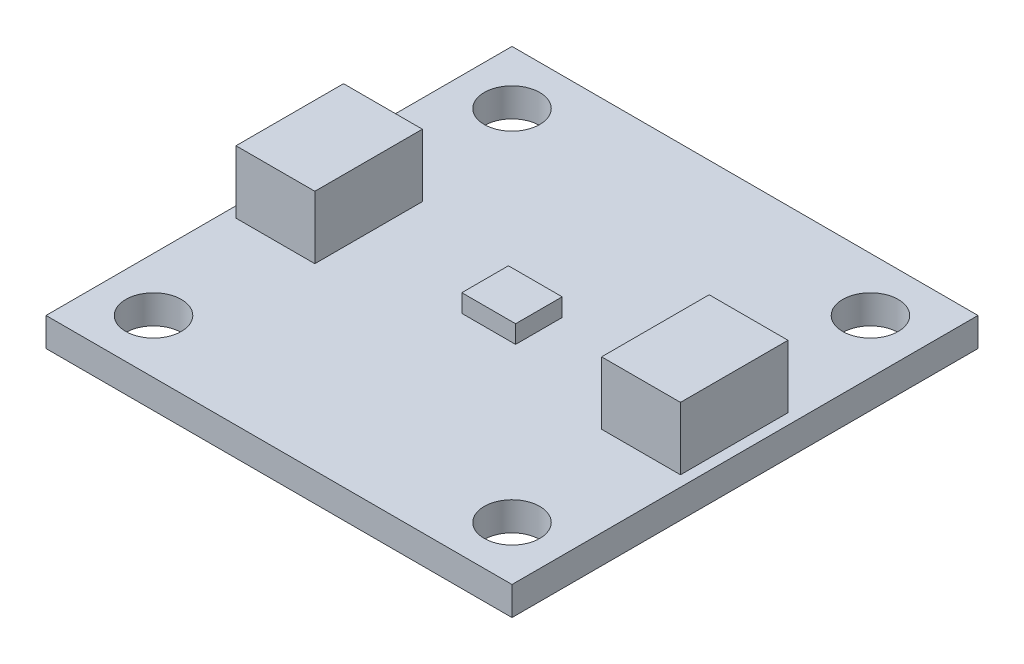
ISO-10303-21;
HEADER;
FILE_DESCRIPTION(('STEP AP214'),'2;1');
FILE_NAME('part.step','',(''),(''),'','','');
FILE_SCHEMA(('AUTOMOTIVE_DESIGN { 1 0 10303 214 1 1 1 1 }'));
ENDSEC;
DATA;
#1=APPLICATION_CONTEXT('core data for automotive mechanical design processes');
#2=APPLICATION_PROTOCOL_DEFINITION('international standard','automotive_design',2000,#1);
#3=PRODUCT_CONTEXT('',#1,'mechanical');
#4=PRODUCT('Part','Part','',(#3));
#5=PRODUCT_RELATED_PRODUCT_CATEGORY('part','',(#4));
#6=PRODUCT_DEFINITION_FORMATION('','',#4);
#7=PRODUCT_DEFINITION_CONTEXT('part definition',#1,'design');
#8=PRODUCT_DEFINITION('design','',#6,#7);
#9=PRODUCT_DEFINITION_SHAPE('','',#8);
#10=(LENGTH_UNIT() NAMED_UNIT(*) SI_UNIT(.MILLI.,.METRE.));
#11=(NAMED_UNIT(*) PLANE_ANGLE_UNIT() SI_UNIT($,.RADIAN.));
#12=(NAMED_UNIT(*) SI_UNIT($,.STERADIAN.) SOLID_ANGLE_UNIT());
#13=UNCERTAINTY_MEASURE_WITH_UNIT(LENGTH_MEASURE(1.E-05),#10,'distance_accuracy_value','');
#14=(GEOMETRIC_REPRESENTATION_CONTEXT(3) GLOBAL_UNCERTAINTY_ASSIGNED_CONTEXT((#13)) GLOBAL_UNIT_ASSIGNED_CONTEXT((#10,
#11,#12)) REPRESENTATION_CONTEXT('',''));
#15=CARTESIAN_POINT('',(0.,0.,0.));
#16=DIRECTION('',(0.,0.,1.));
#17=DIRECTION('',(1.,0.,0.));
#18=AXIS2_PLACEMENT_3D('',#15,#16,#17);
#19=CARTESIAN_POINT('',(0.,1.6,0.));
#20=DIRECTION('',(0.,-1.,0.));
#21=DIRECTION('',(0.,0.,-1.));
#22=AXIS2_PLACEMENT_3D('',#19,#20,#21);
#23=PLANE('',#22);
#24=DIRECTION('',(0.,0.,1.));
#25=VECTOR('',#24,1.);
#26=CARTESIAN_POINT('',(8.,1.6,3.));
#27=LINE('',#26,#25);
#28=CARTESIAN_POINT('',(8.,1.6,-3.));
#29=VERTEX_POINT('',#28);
#30=CARTESIAN_POINT('',(8.,1.6,3.));
#31=VERTEX_POINT('',#30);
#32=EDGE_CURVE('E167',#29,#31,#27,.T.);
#33=ORIENTED_EDGE('',*,*,#32,.F.);
#34=DIRECTION('',(-1.,0.,0.));
#35=VECTOR('',#34,1.);
#36=CARTESIAN_POINT('',(12.4,1.6,-3.));
#37=LINE('',#36,#35);
#38=CARTESIAN_POINT('',(12.4,1.6,-3.));
#39=VERTEX_POINT('',#38);
#40=EDGE_CURVE('E180',#39,#29,#37,.T.);
#41=ORIENTED_EDGE('',*,*,#40,.F.);
#42=DIRECTION('',(0.,0.,-1.));
#43=VECTOR('',#42,1.);
#44=CARTESIAN_POINT('',(12.4,1.6,3.));
#45=LINE('',#44,#43);
#46=CARTESIAN_POINT('',(12.4,1.6,3.));
#47=VERTEX_POINT('',#46);
#48=EDGE_CURVE('E189',#47,#39,#45,.T.);
#49=ORIENTED_EDGE('',*,*,#48,.F.);
#50=DIRECTION('',(1.,0.,0.));
#51=VECTOR('',#50,1.);
#52=CARTESIAN_POINT('',(12.4,1.6,3.));
#53=LINE('',#52,#51);
#54=EDGE_CURVE('E170',#31,#47,#53,.T.);
#55=ORIENTED_EDGE('',*,*,#54,.F.);
#56=EDGE_LOOP('',(#33,#41,#49,#55));
#57=FACE_BOUND('',#56,.T.);
#58=CARTESIAN_POINT('',(-10.,1.6,10.));
#59=DIRECTION('',(0.,1.,0.));
#60=DIRECTION('',(0.,0.,1.));
#61=AXIS2_PLACEMENT_3D('',#58,#59,#60);
#62=CIRCLE('',#61,1.55);
#63=CARTESIAN_POINT('',(-10.,1.6,11.55));
#64=VERTEX_POINT('',#63);
#65=EDGE_CURVE('E239',#64,#64,#62,.T.);
#66=ORIENTED_EDGE('',*,*,#65,.F.);
#67=EDGE_LOOP('',(#66));
#68=FACE_BOUND('',#67,.T.);
#69=CARTESIAN_POINT('',(10.,1.6,10.));
#70=DIRECTION('',(0.,1.,0.));
#71=DIRECTION('',(0.,0.,1.));
#72=AXIS2_PLACEMENT_3D('',#69,#70,#71);
#73=CIRCLE('',#72,1.55);
#74=CARTESIAN_POINT('',(10.,1.6,11.55));
#75=VERTEX_POINT('',#74);
#76=EDGE_CURVE('E245',#75,#75,#73,.T.);
#77=ORIENTED_EDGE('',*,*,#76,.F.);
#78=EDGE_LOOP('',(#77));
#79=FACE_BOUND('',#78,.T.);
#80=CARTESIAN_POINT('',(10.,1.6,-10.));
#81=DIRECTION('',(0.,1.,0.));
#82=DIRECTION('',(0.,0.,1.));
#83=AXIS2_PLACEMENT_3D('',#80,#81,#82);
#84=CIRCLE('',#83,1.55);
#85=CARTESIAN_POINT('',(10.,1.6,-8.45));
#86=VERTEX_POINT('',#85);
#87=EDGE_CURVE('E251',#86,#86,#84,.T.);
#88=ORIENTED_EDGE('',*,*,#87,.F.);
#89=EDGE_LOOP('',(#88));
#90=FACE_BOUND('',#89,.T.);
#91=CARTESIAN_POINT('',(-10.,1.6,-10.));
#92=DIRECTION('',(0.,1.,0.));
#93=DIRECTION('',(0.,0.,1.));
#94=AXIS2_PLACEMENT_3D('',#91,#92,#93);
#95=CIRCLE('',#94,1.55);
#96=CARTESIAN_POINT('',(-10.,1.6,-8.45));
#97=VERTEX_POINT('',#96);
#98=EDGE_CURVE('E257',#97,#97,#95,.T.);
#99=ORIENTED_EDGE('',*,*,#98,.F.);
#100=EDGE_LOOP('',(#99));
#101=FACE_BOUND('',#100,.T.);
#102=DIRECTION('',(0.,0.,-1.));
#103=VECTOR('',#102,1.);
#104=CARTESIAN_POINT('',(13.,1.6,13.));
#105=LINE('',#104,#103);
#106=CARTESIAN_POINT('',(13.,1.6,13.));
#107=VERTEX_POINT('',#106);
#108=CARTESIAN_POINT('',(13.,1.6,-13.));
#109=VERTEX_POINT('',#108);
#110=EDGE_CURVE('E263',#107,#109,#105,.T.);
#111=ORIENTED_EDGE('',*,*,#110,.T.);
#112=DIRECTION('',(-1.,0.,0.));
#113=VECTOR('',#112,1.);
#114=CARTESIAN_POINT('',(-13.,1.6,-13.));
#115=LINE('',#114,#113);
#116=CARTESIAN_POINT('',(-13.,1.6,-13.));
#117=VERTEX_POINT('',#116);
#118=EDGE_CURVE('E266',#109,#117,#115,.T.);
#119=ORIENTED_EDGE('',*,*,#118,.T.);
#120=DIRECTION('',(0.,0.,1.));
#121=VECTOR('',#120,1.);
#122=CARTESIAN_POINT('',(-13.,1.6,13.));
#123=LINE('',#122,#121);
#124=CARTESIAN_POINT('',(-13.,1.6,13.));
#125=VERTEX_POINT('',#124);
#126=EDGE_CURVE('E269',#117,#125,#123,.T.);
#127=ORIENTED_EDGE('',*,*,#126,.T.);
#128=DIRECTION('',(1.,0.,0.));
#129=VECTOR('',#128,1.);
#130=CARTESIAN_POINT('',(-13.,1.6,13.));
#131=LINE('',#130,#129);
#132=EDGE_CURVE('E271',#125,#107,#131,.T.);
#133=ORIENTED_EDGE('',*,*,#132,.T.);
#134=EDGE_LOOP('',(#111,#119,#127,#133));
#135=FACE_BOUND('',#134,.T.);
#136=DIRECTION('',(0.,0.,1.));
#137=VECTOR('',#136,1.);
#138=CARTESIAN_POINT('',(-12.4,1.6,3.));
#139=LINE('',#138,#137);
#140=CARTESIAN_POINT('',(-12.4,1.6,-3.));
#141=VERTEX_POINT('',#140);
#142=CARTESIAN_POINT('',(-12.4,1.6,3.));
#143=VERTEX_POINT('',#142);
#144=EDGE_CURVE('E205',#141,#143,#139,.T.);
#145=ORIENTED_EDGE('',*,*,#144,.F.);
#146=DIRECTION('',(-1.,0.,0.));
#147=VECTOR('',#146,1.);
#148=CARTESIAN_POINT('',(-8.,1.6,-3.));
#149=LINE('',#148,#147);
#150=CARTESIAN_POINT('',(-8.,1.6,-3.));
#151=VERTEX_POINT('',#150);
#152=EDGE_CURVE('E210',#151,#141,#149,.T.);
#153=ORIENTED_EDGE('',*,*,#152,.F.);
#154=DIRECTION('',(0.,0.,-1.));
#155=VECTOR('',#154,1.);
#156=CARTESIAN_POINT('',(-8.,1.6,3.));
#157=LINE('',#156,#155);
#158=CARTESIAN_POINT('',(-8.,1.6,3.));
#159=VERTEX_POINT('',#158);
#160=EDGE_CURVE('E222',#159,#151,#157,.T.);
#161=ORIENTED_EDGE('',*,*,#160,.F.);
#162=DIRECTION('',(1.,0.,0.));
#163=VECTOR('',#162,1.);
#164=CARTESIAN_POINT('',(-8.,1.6,3.));
#165=LINE('',#164,#163);
#166=EDGE_CURVE('E219',#143,#159,#165,.T.);
#167=ORIENTED_EDGE('',*,*,#166,.F.);
#168=EDGE_LOOP('',(#145,#153,#161,#167));
#169=FACE_BOUND('',#168,.T.);
#170=DIRECTION('',(0.,0.,-1.));
#171=VECTOR('',#170,1.);
#172=CARTESIAN_POINT('',(1.5,1.6,1.3));
#173=LINE('',#172,#171);
#174=CARTESIAN_POINT('',(1.5,1.6,1.3));
#175=VERTEX_POINT('',#174);
#176=CARTESIAN_POINT('',(1.5,1.6,-1.3));
#177=VERTEX_POINT('',#176);
#178=EDGE_CURVE('E166',#175,#177,#173,.T.);
#179=ORIENTED_EDGE('',*,*,#178,.F.);
#180=DIRECTION('',(1.,0.,0.));
#181=VECTOR('',#180,1.);
#182=CARTESIAN_POINT('',(-1.5,1.6,1.3));
#183=LINE('',#182,#181);
#184=CARTESIAN_POINT('',(-1.5,1.6,1.3));
#185=VERTEX_POINT('',#184);
#186=EDGE_CURVE('E163',#185,#175,#183,.T.);
#187=ORIENTED_EDGE('',*,*,#186,.F.);
#188=DIRECTION('',(0.,0.,1.));
#189=VECTOR('',#188,1.);
#190=CARTESIAN_POINT('',(-1.5,1.6,1.3));
#191=LINE('',#190,#189);
#192=CARTESIAN_POINT('',(-1.5,1.6,-1.3));
#193=VERTEX_POINT('',#192);
#194=EDGE_CURVE('E53',#193,#185,#191,.T.);
#195=ORIENTED_EDGE('',*,*,#194,.F.);
#196=DIRECTION('',(-1.,0.,0.));
#197=VECTOR('',#196,1.);
#198=CARTESIAN_POINT('',(-1.5,1.6,-1.3));
#199=LINE('',#198,#197);
#200=EDGE_CURVE('E48',#177,#193,#199,.T.);
#201=ORIENTED_EDGE('',*,*,#200,.F.);
#202=EDGE_LOOP('',(#179,#187,#195,#201));
#203=FACE_BOUND('',#202,.T.);
#204=ADVANCED_FACE('F33',(#57,#68,#79,#90,#101,#135,#169,#203),#23,.F.);
#205=CARTESIAN_POINT('',(0.,0.,0.));
#206=DIRECTION('',(0.,-1.,0.));
#207=DIRECTION('',(0.,0.,-1.));
#208=AXIS2_PLACEMENT_3D('',#205,#206,#207);
#209=PLANE('',#208);
#210=CARTESIAN_POINT('',(10.,0.,10.));
#211=DIRECTION('',(0.,1.,0.));
#212=DIRECTION('',(0.,0.,1.));
#213=AXIS2_PLACEMENT_3D('',#210,#211,#212);
#214=CIRCLE('',#213,1.55);
#215=CARTESIAN_POINT('',(10.,0.,11.55));
#216=VERTEX_POINT('',#215);
#217=EDGE_CURVE('E242',#216,#216,#214,.T.);
#218=ORIENTED_EDGE('',*,*,#217,.T.);
#219=EDGE_LOOP('',(#218));
#220=FACE_BOUND('',#219,.T.);
#221=CARTESIAN_POINT('',(-10.,0.,-10.));
#222=DIRECTION('',(0.,1.,0.));
#223=DIRECTION('',(0.,0.,1.));
#224=AXIS2_PLACEMENT_3D('',#221,#222,#223);
#225=CIRCLE('',#224,1.55);
#226=CARTESIAN_POINT('',(-10.,0.,-8.45));
#227=VERTEX_POINT('',#226);
#228=EDGE_CURVE('E254',#227,#227,#225,.T.);
#229=ORIENTED_EDGE('',*,*,#228,.T.);
#230=EDGE_LOOP('',(#229));
#231=FACE_BOUND('',#230,.T.);
#232=DIRECTION('',(0.,0.,-1.));
#233=VECTOR('',#232,1.);
#234=CARTESIAN_POINT('',(13.,0.,13.));
#235=LINE('',#234,#233);
#236=CARTESIAN_POINT('',(13.,0.,13.));
#237=VERTEX_POINT('',#236);
#238=CARTESIAN_POINT('',(13.,0.,-13.));
#239=VERTEX_POINT('',#238);
#240=EDGE_CURVE('E260',#237,#239,#235,.T.);
#241=ORIENTED_EDGE('',*,*,#240,.F.);
#242=DIRECTION('',(1.,0.,0.));
#243=VECTOR('',#242,1.);
#244=CARTESIAN_POINT('',(-13.,0.,13.));
#245=LINE('',#244,#243);
#246=CARTESIAN_POINT('',(-13.,0.,13.));
#247=VERTEX_POINT('',#246);
#248=EDGE_CURVE('E267',#247,#237,#245,.T.);
#249=ORIENTED_EDGE('',*,*,#248,.F.);
#250=DIRECTION('',(0.,0.,1.));
#251=VECTOR('',#250,1.);
#252=CARTESIAN_POINT('',(-13.,0.,13.));
#253=LINE('',#252,#251);
#254=CARTESIAN_POINT('',(-13.,0.,-13.));
#255=VERTEX_POINT('',#254);
#256=EDGE_CURVE('E278',#255,#247,#253,.T.);
#257=ORIENTED_EDGE('',*,*,#256,.F.);
#258=DIRECTION('',(-1.,0.,0.));
#259=VECTOR('',#258,1.);
#260=CARTESIAN_POINT('',(-13.,0.,-13.));
#261=LINE('',#260,#259);
#262=EDGE_CURVE('E276',#239,#255,#261,.T.);
#263=ORIENTED_EDGE('',*,*,#262,.F.);
#264=EDGE_LOOP('',(#241,#249,#257,#263));
#265=FACE_BOUND('',#264,.T.);
#266=CARTESIAN_POINT('',(10.,0.,-10.));
#267=DIRECTION('',(0.,1.,0.));
#268=DIRECTION('',(0.,0.,1.));
#269=AXIS2_PLACEMENT_3D('',#266,#267,#268);
#270=CIRCLE('',#269,1.55);
#271=CARTESIAN_POINT('',(10.,0.,-8.45));
#272=VERTEX_POINT('',#271);
#273=EDGE_CURVE('E248',#272,#272,#270,.T.);
#274=ORIENTED_EDGE('',*,*,#273,.T.);
#275=EDGE_LOOP('',(#274));
#276=FACE_BOUND('',#275,.T.);
#277=CARTESIAN_POINT('',(-10.,0.,10.));
#278=DIRECTION('',(0.,1.,0.));
#279=DIRECTION('',(0.,0.,1.));
#280=AXIS2_PLACEMENT_3D('',#277,#278,#279);
#281=CIRCLE('',#280,1.55);
#282=CARTESIAN_POINT('',(-10.,0.,11.55));
#283=VERTEX_POINT('',#282);
#284=EDGE_CURVE('E238',#283,#283,#281,.T.);
#285=ORIENTED_EDGE('',*,*,#284,.T.);
#286=EDGE_LOOP('',(#285));
#287=FACE_BOUND('',#286,.T.);
#288=ADVANCED_FACE('F296',(#220,#231,#265,#276,#287),#209,.T.);
#289=CARTESIAN_POINT('',(13.,1.6,13.));
#290=DIRECTION('',(-1.,0.,0.));
#291=DIRECTION('',(0.,0.,1.));
#292=AXIS2_PLACEMENT_3D('',#289,#290,#291);
#293=PLANE('',#292);
#294=ORIENTED_EDGE('',*,*,#240,.T.);
#295=DIRECTION('',(0.,-1.,0.));
#296=VECTOR('',#295,1.);
#297=CARTESIAN_POINT('',(13.,1.6,-13.));
#298=LINE('',#297,#296);
#299=EDGE_CURVE('E11',#109,#239,#298,.T.);
#300=ORIENTED_EDGE('',*,*,#299,.F.);
#301=ORIENTED_EDGE('',*,*,#110,.F.);
#302=DIRECTION('',(0.,-1.,0.));
#303=VECTOR('',#302,1.);
#304=CARTESIAN_POINT('',(13.,1.6,13.));
#305=LINE('',#304,#303);
#306=EDGE_CURVE('E273',#107,#237,#305,.T.);
#307=ORIENTED_EDGE('',*,*,#306,.T.);
#308=EDGE_LOOP('',(#294,#300,#301,#307));
#309=FACE_BOUND('',#308,.T.);
#310=ADVANCED_FACE('F35',(#309),#293,.F.);
#311=CARTESIAN_POINT('',(-13.,1.6,-13.));
#312=DIRECTION('',(0.,0.,1.));
#313=DIRECTION('',(1.,0.,0.));
#314=AXIS2_PLACEMENT_3D('',#311,#312,#313);
#315=PLANE('',#314);
#316=ORIENTED_EDGE('',*,*,#262,.T.);
#317=DIRECTION('',(0.,-1.,0.));
#318=VECTOR('',#317,1.);
#319=CARTESIAN_POINT('',(-13.,1.6,-13.));
#320=LINE('',#319,#318);
#321=EDGE_CURVE('E41',#117,#255,#320,.T.);
#322=ORIENTED_EDGE('',*,*,#321,.F.);
#323=ORIENTED_EDGE('',*,*,#118,.F.);
#324=ORIENTED_EDGE('',*,*,#299,.T.);
#325=EDGE_LOOP('',(#316,#322,#323,#324));
#326=FACE_BOUND('',#325,.T.);
#327=ADVANCED_FACE('F307',(#326),#315,.F.);
#328=CARTESIAN_POINT('',(-13.,1.6,13.));
#329=DIRECTION('',(1.,0.,0.));
#330=DIRECTION('',(0.,0.,-1.));
#331=AXIS2_PLACEMENT_3D('',#328,#329,#330);
#332=PLANE('',#331);
#333=ORIENTED_EDGE('',*,*,#256,.T.);
#334=DIRECTION('',(0.,-1.,0.));
#335=VECTOR('',#334,1.);
#336=CARTESIAN_POINT('',(-13.,1.6,13.));
#337=LINE('',#336,#335);
#338=EDGE_CURVE('E283',#125,#247,#337,.T.);
#339=ORIENTED_EDGE('',*,*,#338,.F.);
#340=ORIENTED_EDGE('',*,*,#126,.F.);
#341=ORIENTED_EDGE('',*,*,#321,.T.);
#342=EDGE_LOOP('',(#333,#339,#340,#341));
#343=FACE_BOUND('',#342,.T.);
#344=ADVANCED_FACE('F290',(#343),#332,.F.);
#345=CARTESIAN_POINT('',(-13.,1.6,13.));
#346=DIRECTION('',(0.,0.,-1.));
#347=DIRECTION('',(-1.,0.,0.));
#348=AXIS2_PLACEMENT_3D('',#345,#346,#347);
#349=PLANE('',#348);
#350=ORIENTED_EDGE('',*,*,#248,.T.);
#351=ORIENTED_EDGE('',*,*,#306,.F.);
#352=ORIENTED_EDGE('',*,*,#132,.F.);
#353=ORIENTED_EDGE('',*,*,#338,.T.);
#354=EDGE_LOOP('',(#350,#351,#352,#353));
#355=FACE_BOUND('',#354,.T.);
#356=ADVANCED_FACE('F300',(#355),#349,.F.);
#357=CARTESIAN_POINT('',(-10.,1.6,-10.));
#358=DIRECTION('',(0.,-1.,0.));
#359=DIRECTION('',(0.,0.,-1.));
#360=AXIS2_PLACEMENT_3D('',#357,#358,#359);
#361=CYLINDRICAL_SURFACE('',#360,1.55);
#362=ORIENTED_EDGE('',*,*,#98,.T.);
#363=EDGE_LOOP('',(#362));
#364=FACE_BOUND('',#363,.T.);
#365=ORIENTED_EDGE('',*,*,#228,.F.);
#366=EDGE_LOOP('',(#365));
#367=FACE_BOUND('',#366,.T.);
#368=ADVANCED_FACE('F324',(#364,#367),#361,.F.);
#369=CARTESIAN_POINT('',(10.,1.6,-10.));
#370=DIRECTION('',(0.,-1.,0.));
#371=DIRECTION('',(0.,0.,-1.));
#372=AXIS2_PLACEMENT_3D('',#369,#370,#371);
#373=CYLINDRICAL_SURFACE('',#372,1.55);
#374=ORIENTED_EDGE('',*,*,#87,.T.);
#375=EDGE_LOOP('',(#374));
#376=FACE_BOUND('',#375,.T.);
#377=ORIENTED_EDGE('',*,*,#273,.F.);
#378=EDGE_LOOP('',(#377));
#379=FACE_BOUND('',#378,.T.);
#380=ADVANCED_FACE('F331',(#376,#379),#373,.F.);
#381=CARTESIAN_POINT('',(10.,1.6,10.));
#382=DIRECTION('',(0.,-1.,0.));
#383=DIRECTION('',(0.,0.,-1.));
#384=AXIS2_PLACEMENT_3D('',#381,#382,#383);
#385=CYLINDRICAL_SURFACE('',#384,1.55);
#386=ORIENTED_EDGE('',*,*,#76,.T.);
#387=EDGE_LOOP('',(#386));
#388=FACE_BOUND('',#387,.T.);
#389=ORIENTED_EDGE('',*,*,#217,.F.);
#390=EDGE_LOOP('',(#389));
#391=FACE_BOUND('',#390,.T.);
#392=ADVANCED_FACE('F336',(#388,#391),#385,.F.);
#393=CARTESIAN_POINT('',(-10.,1.6,10.));
#394=DIRECTION('',(0.,-1.,0.));
#395=DIRECTION('',(0.,0.,-1.));
#396=AXIS2_PLACEMENT_3D('',#393,#394,#395);
#397=CYLINDRICAL_SURFACE('',#396,1.55);
#398=ORIENTED_EDGE('',*,*,#65,.T.);
#399=EDGE_LOOP('',(#398));
#400=FACE_BOUND('',#399,.T.);
#401=ORIENTED_EDGE('',*,*,#284,.F.);
#402=EDGE_LOOP('',(#401));
#403=FACE_BOUND('',#402,.T.);
#404=ADVANCED_FACE('F346',(#400,#403),#397,.F.);
#405=CARTESIAN_POINT('',(-12.4,5.1,3.));
#406=DIRECTION('',(1.,0.,0.));
#407=DIRECTION('',(0.,0.,-1.));
#408=AXIS2_PLACEMENT_3D('',#405,#406,#407);
#409=PLANE('',#408);
#410=ORIENTED_EDGE('',*,*,#144,.T.);
#411=DIRECTION('',(0.,-1.,0.));
#412=VECTOR('',#411,1.);
#413=CARTESIAN_POINT('',(-12.4,5.1,3.));
#414=LINE('',#413,#412);
#415=CARTESIAN_POINT('',(-12.4,5.1,3.));
#416=VERTEX_POINT('',#415);
#417=EDGE_CURVE('E235',#416,#143,#414,.T.);
#418=ORIENTED_EDGE('',*,*,#417,.F.);
#419=DIRECTION('',(0.,0.,1.));
#420=VECTOR('',#419,1.);
#421=CARTESIAN_POINT('',(-12.4,5.1,3.));
#422=LINE('',#421,#420);
#423=CARTESIAN_POINT('',(-12.4,5.1,-3.));
#424=VERTEX_POINT('',#423);
#425=EDGE_CURVE('E206',#424,#416,#422,.T.);
#426=ORIENTED_EDGE('',*,*,#425,.F.);
#427=DIRECTION('',(0.,-1.,0.));
#428=VECTOR('',#427,1.);
#429=CARTESIAN_POINT('',(-12.4,5.1,-3.));
#430=LINE('',#429,#428);
#431=EDGE_CURVE('E216',#424,#141,#430,.T.);
#432=ORIENTED_EDGE('',*,*,#431,.T.);
#433=EDGE_LOOP('',(#410,#418,#426,#432));
#434=FACE_BOUND('',#433,.T.);
#435=ADVANCED_FACE('F353',(#434),#409,.F.);
#436=CARTESIAN_POINT('',(-8.,5.1,3.));
#437=DIRECTION('',(0.,0.,-1.));
#438=DIRECTION('',(-1.,0.,0.));
#439=AXIS2_PLACEMENT_3D('',#436,#437,#438);
#440=PLANE('',#439);
#441=ORIENTED_EDGE('',*,*,#166,.T.);
#442=DIRECTION('',(0.,-1.,0.));
#443=VECTOR('',#442,1.);
#444=CARTESIAN_POINT('',(-8.,5.1,3.));
#445=LINE('',#444,#443);
#446=CARTESIAN_POINT('',(-8.,5.1,3.));
#447=VERTEX_POINT('',#446);
#448=EDGE_CURVE('E232',#447,#159,#445,.T.);
#449=ORIENTED_EDGE('',*,*,#448,.F.);
#450=DIRECTION('',(1.,0.,0.));
#451=VECTOR('',#450,1.);
#452=CARTESIAN_POINT('',(-8.,5.1,3.));
#453=LINE('',#452,#451);
#454=EDGE_CURVE('E209',#416,#447,#453,.T.);
#455=ORIENTED_EDGE('',*,*,#454,.F.);
#456=ORIENTED_EDGE('',*,*,#417,.T.);
#457=EDGE_LOOP('',(#441,#449,#455,#456));
#458=FACE_BOUND('',#457,.T.);
#459=ADVANCED_FACE('F357',(#458),#440,.F.);
#460=CARTESIAN_POINT('',(-8.,5.1,3.));
#461=DIRECTION('',(-1.,0.,0.));
#462=DIRECTION('',(0.,0.,1.));
#463=AXIS2_PLACEMENT_3D('',#460,#461,#462);
#464=PLANE('',#463);
#465=ORIENTED_EDGE('',*,*,#160,.T.);
#466=DIRECTION('',(0.,-1.,0.));
#467=VECTOR('',#466,1.);
#468=CARTESIAN_POINT('',(-8.,5.1,-3.));
#469=LINE('',#468,#467);
#470=CARTESIAN_POINT('',(-8.,5.1,-3.));
#471=VERTEX_POINT('',#470);
#472=EDGE_CURVE('E229',#471,#151,#469,.T.);
#473=ORIENTED_EDGE('',*,*,#472,.F.);
#474=DIRECTION('',(0.,0.,-1.));
#475=VECTOR('',#474,1.);
#476=CARTESIAN_POINT('',(-8.,5.1,3.));
#477=LINE('',#476,#475);
#478=EDGE_CURVE('E212',#447,#471,#477,.T.);
#479=ORIENTED_EDGE('',*,*,#478,.F.);
#480=ORIENTED_EDGE('',*,*,#448,.T.);
#481=EDGE_LOOP('',(#465,#473,#479,#480));
#482=FACE_BOUND('',#481,.T.);
#483=ADVANCED_FACE('F361',(#482),#464,.F.);
#484=CARTESIAN_POINT('',(-8.,5.1,-3.));
#485=DIRECTION('',(0.,0.,1.));
#486=DIRECTION('',(1.,0.,0.));
#487=AXIS2_PLACEMENT_3D('',#484,#485,#486);
#488=PLANE('',#487);
#489=ORIENTED_EDGE('',*,*,#152,.T.);
#490=ORIENTED_EDGE('',*,*,#431,.F.);
#491=DIRECTION('',(-1.,0.,0.));
#492=VECTOR('',#491,1.);
#493=CARTESIAN_POINT('',(-8.,5.1,-3.));
#494=LINE('',#493,#492);
#495=EDGE_CURVE('E214',#471,#424,#494,.T.);
#496=ORIENTED_EDGE('',*,*,#495,.F.);
#497=ORIENTED_EDGE('',*,*,#472,.T.);
#498=EDGE_LOOP('',(#489,#490,#496,#497));
#499=FACE_BOUND('',#498,.T.);
#500=ADVANCED_FACE('F365',(#499),#488,.F.);
#501=CARTESIAN_POINT('',(0.,5.1,0.));
#502=DIRECTION('',(0.,1.,0.));
#503=DIRECTION('',(0.,0.,1.));
#504=AXIS2_PLACEMENT_3D('',#501,#502,#503);
#505=PLANE('',#504);
#506=ORIENTED_EDGE('',*,*,#425,.T.);
#507=ORIENTED_EDGE('',*,*,#454,.T.);
#508=ORIENTED_EDGE('',*,*,#478,.T.);
#509=ORIENTED_EDGE('',*,*,#495,.T.);
#510=EDGE_LOOP('',(#506,#507,#508,#509));
#511=FACE_BOUND('',#510,.T.);
#512=ADVANCED_FACE('F369',(#511),#505,.T.);
#513=CARTESIAN_POINT('',(8.,5.1,3.));
#514=DIRECTION('',(1.,0.,0.));
#515=DIRECTION('',(0.,0.,-1.));
#516=AXIS2_PLACEMENT_3D('',#513,#514,#515);
#517=PLANE('',#516);
#518=ORIENTED_EDGE('',*,*,#32,.T.);
#519=DIRECTION('',(0.,-1.,0.));
#520=VECTOR('',#519,1.);
#521=CARTESIAN_POINT('',(8.,5.1,3.));
#522=LINE('',#521,#520);
#523=CARTESIAN_POINT('',(8.,5.1,3.));
#524=VERTEX_POINT('',#523);
#525=EDGE_CURVE('E202',#524,#31,#522,.T.);
#526=ORIENTED_EDGE('',*,*,#525,.F.);
#527=DIRECTION('',(0.,0.,1.));
#528=VECTOR('',#527,1.);
#529=CARTESIAN_POINT('',(8.,5.1,3.));
#530=LINE('',#529,#528);
#531=CARTESIAN_POINT('',(8.,5.1,-3.));
#532=VERTEX_POINT('',#531);
#533=EDGE_CURVE('E176',#532,#524,#530,.T.);
#534=ORIENTED_EDGE('',*,*,#533,.F.);
#535=DIRECTION('',(0.,-1.,0.));
#536=VECTOR('',#535,1.);
#537=CARTESIAN_POINT('',(8.,5.1,-3.));
#538=LINE('',#537,#536);
#539=EDGE_CURVE('E185',#532,#29,#538,.T.);
#540=ORIENTED_EDGE('',*,*,#539,.T.);
#541=EDGE_LOOP('',(#518,#526,#534,#540));
#542=FACE_BOUND('',#541,.T.);
#543=ADVANCED_FACE('F373',(#542),#517,.F.);
#544=CARTESIAN_POINT('',(12.4,5.1,3.));
#545=DIRECTION('',(0.,0.,-1.));
#546=DIRECTION('',(-1.,0.,0.));
#547=AXIS2_PLACEMENT_3D('',#544,#545,#546);
#548=PLANE('',#547);
#549=ORIENTED_EDGE('',*,*,#54,.T.);
#550=DIRECTION('',(0.,-1.,0.));
#551=VECTOR('',#550,1.);
#552=CARTESIAN_POINT('',(12.4,5.1,3.));
#553=LINE('',#552,#551);
#554=CARTESIAN_POINT('',(12.4,5.1,3.));
#555=VERTEX_POINT('',#554);
#556=EDGE_CURVE('E199',#555,#47,#553,.T.);
#557=ORIENTED_EDGE('',*,*,#556,.F.);
#558=DIRECTION('',(1.,0.,0.));
#559=VECTOR('',#558,1.);
#560=CARTESIAN_POINT('',(12.4,5.1,3.));
#561=LINE('',#560,#559);
#562=EDGE_CURVE('E179',#524,#555,#561,.T.);
#563=ORIENTED_EDGE('',*,*,#562,.F.);
#564=ORIENTED_EDGE('',*,*,#525,.T.);
#565=EDGE_LOOP('',(#549,#557,#563,#564));
#566=FACE_BOUND('',#565,.T.);
#567=ADVANCED_FACE('F377',(#566),#548,.F.);
#568=CARTESIAN_POINT('',(12.4,5.1,3.));
#569=DIRECTION('',(-1.,0.,0.));
#570=DIRECTION('',(0.,0.,1.));
#571=AXIS2_PLACEMENT_3D('',#568,#569,#570);
#572=PLANE('',#571);
#573=ORIENTED_EDGE('',*,*,#48,.T.);
#574=DIRECTION('',(0.,-1.,0.));
#575=VECTOR('',#574,1.);
#576=CARTESIAN_POINT('',(12.4,5.1,-3.));
#577=LINE('',#576,#575);
#578=CARTESIAN_POINT('',(12.4,5.1,-3.));
#579=VERTEX_POINT('',#578);
#580=EDGE_CURVE('E196',#579,#39,#577,.T.);
#581=ORIENTED_EDGE('',*,*,#580,.F.);
#582=DIRECTION('',(0.,0.,-1.));
#583=VECTOR('',#582,1.);
#584=CARTESIAN_POINT('',(12.4,5.1,3.));
#585=LINE('',#584,#583);
#586=EDGE_CURVE('E182',#555,#579,#585,.T.);
#587=ORIENTED_EDGE('',*,*,#586,.F.);
#588=ORIENTED_EDGE('',*,*,#556,.T.);
#589=EDGE_LOOP('',(#573,#581,#587,#588));
#590=FACE_BOUND('',#589,.T.);
#591=ADVANCED_FACE('F381',(#590),#572,.F.);
#592=CARTESIAN_POINT('',(12.4,5.1,-3.));
#593=DIRECTION('',(0.,0.,1.));
#594=DIRECTION('',(1.,0.,0.));
#595=AXIS2_PLACEMENT_3D('',#592,#593,#594);
#596=PLANE('',#595);
#597=ORIENTED_EDGE('',*,*,#40,.T.);
#598=ORIENTED_EDGE('',*,*,#539,.F.);
#599=DIRECTION('',(-1.,0.,0.));
#600=VECTOR('',#599,1.);
#601=CARTESIAN_POINT('',(12.4,5.1,-3.));
#602=LINE('',#601,#600);
#603=EDGE_CURVE('E184',#579,#532,#602,.T.);
#604=ORIENTED_EDGE('',*,*,#603,.F.);
#605=ORIENTED_EDGE('',*,*,#580,.T.);
#606=EDGE_LOOP('',(#597,#598,#604,#605));
#607=FACE_BOUND('',#606,.T.);
#608=ADVANCED_FACE('F385',(#607),#596,.F.);
#609=CARTESIAN_POINT('',(0.,5.1,0.));
#610=DIRECTION('',(0.,1.,0.));
#611=DIRECTION('',(0.,0.,1.));
#612=AXIS2_PLACEMENT_3D('',#609,#610,#611);
#613=PLANE('',#612);
#614=ORIENTED_EDGE('',*,*,#533,.T.);
#615=ORIENTED_EDGE('',*,*,#562,.T.);
#616=ORIENTED_EDGE('',*,*,#586,.T.);
#617=ORIENTED_EDGE('',*,*,#603,.T.);
#618=EDGE_LOOP('',(#614,#615,#616,#617));
#619=FACE_BOUND('',#618,.T.);
#620=ADVANCED_FACE('F389',(#619),#613,.T.);
#621=CARTESIAN_POINT('',(1.5,2.6,1.3));
#622=DIRECTION('',(-1.,0.,0.));
#623=DIRECTION('',(0.,0.,1.));
#624=AXIS2_PLACEMENT_3D('',#621,#622,#623);
#625=PLANE('',#624);
#626=ORIENTED_EDGE('',*,*,#178,.T.);
#627=DIRECTION('',(0.,-1.,0.));
#628=VECTOR('',#627,1.);
#629=CARTESIAN_POINT('',(1.5,2.6,-1.3));
#630=LINE('',#629,#628);
#631=CARTESIAN_POINT('',(1.5,2.6,-1.3));
#632=VERTEX_POINT('',#631);
#633=EDGE_CURVE('E147',#632,#177,#630,.T.);
#634=ORIENTED_EDGE('',*,*,#633,.F.);
#635=DIRECTION('',(0.,0.,-1.));
#636=VECTOR('',#635,1.);
#637=CARTESIAN_POINT('',(1.5,2.6,1.3));
#638=LINE('',#637,#636);
#639=CARTESIAN_POINT('',(1.5,2.6,1.3));
#640=VERTEX_POINT('',#639);
#641=EDGE_CURVE('E154',#640,#632,#638,.T.);
#642=ORIENTED_EDGE('',*,*,#641,.F.);
#643=DIRECTION('',(0.,-1.,0.));
#644=VECTOR('',#643,1.);
#645=CARTESIAN_POINT('',(1.5,2.6,1.3));
#646=LINE('',#645,#644);
#647=EDGE_CURVE('E549',#640,#175,#646,.T.);
#648=ORIENTED_EDGE('',*,*,#647,.T.);
#649=EDGE_LOOP('',(#626,#634,#642,#648));
#650=FACE_BOUND('',#649,.T.);
#651=ADVANCED_FACE('F165',(#650),#625,.F.);
#652=CARTESIAN_POINT('',(-1.5,2.6,-1.3));
#653=DIRECTION('',(0.,0.,1.));
#654=DIRECTION('',(1.,0.,0.));
#655=AXIS2_PLACEMENT_3D('',#652,#653,#654);
#656=PLANE('',#655);
#657=ORIENTED_EDGE('',*,*,#200,.T.);
#658=DIRECTION('',(0.,-1.,0.));
#659=VECTOR('',#658,1.);
#660=CARTESIAN_POINT('',(-1.5,2.6,-1.3));
#661=LINE('',#660,#659);
#662=CARTESIAN_POINT('',(-1.5,2.6,-1.3));
#663=VERTEX_POINT('',#662);
#664=EDGE_CURVE('E150',#663,#193,#661,.T.);
#665=ORIENTED_EDGE('',*,*,#664,.F.);
#666=DIRECTION('',(-1.,0.,0.));
#667=VECTOR('',#666,1.);
#668=CARTESIAN_POINT('',(-1.5,2.6,-1.3));
#669=LINE('',#668,#667);
#670=EDGE_CURVE('E143',#632,#663,#669,.T.);
#671=ORIENTED_EDGE('',*,*,#670,.F.);
#672=ORIENTED_EDGE('',*,*,#633,.T.);
#673=EDGE_LOOP('',(#657,#665,#671,#672));
#674=FACE_BOUND('',#673,.T.);
#675=ADVANCED_FACE('F145',(#674),#656,.F.);
#676=CARTESIAN_POINT('',(-1.5,2.6,1.3));
#677=DIRECTION('',(1.,0.,0.));
#678=DIRECTION('',(0.,0.,-1.));
#679=AXIS2_PLACEMENT_3D('',#676,#677,#678);
#680=PLANE('',#679);
#681=ORIENTED_EDGE('',*,*,#194,.T.);
#682=DIRECTION('',(0.,-1.,0.));
#683=VECTOR('',#682,1.);
#684=CARTESIAN_POINT('',(-1.5,2.6,1.3));
#685=LINE('',#684,#683);
#686=CARTESIAN_POINT('',(-1.5,2.6,1.3));
#687=VERTEX_POINT('',#686);
#688=EDGE_CURVE('E172',#687,#185,#685,.T.);
#689=ORIENTED_EDGE('',*,*,#688,.F.);
#690=DIRECTION('',(0.,0.,1.));
#691=VECTOR('',#690,1.);
#692=CARTESIAN_POINT('',(-1.5,2.6,1.3));
#693=LINE('',#692,#691);
#694=EDGE_CURVE('E153',#663,#687,#693,.T.);
#695=ORIENTED_EDGE('',*,*,#694,.F.);
#696=ORIENTED_EDGE('',*,*,#664,.T.);
#697=EDGE_LOOP('',(#681,#689,#695,#696));
#698=FACE_BOUND('',#697,.T.);
#699=ADVANCED_FACE('F398',(#698),#680,.F.);
#700=CARTESIAN_POINT('',(-1.5,2.6,1.3));
#701=DIRECTION('',(0.,0.,-1.));
#702=DIRECTION('',(-1.,0.,0.));
#703=AXIS2_PLACEMENT_3D('',#700,#701,#702);
#704=PLANE('',#703);
#705=ORIENTED_EDGE('',*,*,#186,.T.);
#706=ORIENTED_EDGE('',*,*,#647,.F.);
#707=DIRECTION('',(1.,0.,0.));
#708=VECTOR('',#707,1.);
#709=CARTESIAN_POINT('',(-1.5,2.6,1.3));
#710=LINE('',#709,#708);
#711=EDGE_CURVE('E159',#687,#640,#710,.T.);
#712=ORIENTED_EDGE('',*,*,#711,.F.);
#713=ORIENTED_EDGE('',*,*,#688,.T.);
#714=EDGE_LOOP('',(#705,#706,#712,#713));
#715=FACE_BOUND('',#714,.T.);
#716=ADVANCED_FACE('F401',(#715),#704,.F.);
#717=CARTESIAN_POINT('',(0.,2.6,0.));
#718=DIRECTION('',(0.,-1.,0.));
#719=DIRECTION('',(0.,0.,-1.));
#720=AXIS2_PLACEMENT_3D('',#717,#718,#719);
#721=PLANE('',#720);
#722=ORIENTED_EDGE('',*,*,#641,.T.);
#723=ORIENTED_EDGE('',*,*,#670,.T.);
#724=ORIENTED_EDGE('',*,*,#694,.T.);
#725=ORIENTED_EDGE('',*,*,#711,.T.);
#726=EDGE_LOOP('',(#722,#723,#724,#725));
#727=FACE_BOUND('',#726,.T.);
#728=ADVANCED_FACE('F157',(#727),#721,.F.);
#729=CLOSED_SHELL('',(#204,#288,#310,#327,#344,#356,#368,#380,#392,#404,#435,#459,#483,#500,
#512,#543,#567,#591,#608,#620,#651,#675,#699,#716,#728));
#730=MANIFOLD_SOLID_BREP('B2',#729);
#731=ADVANCED_BREP_SHAPE_REPRESENTATION('',(#18,#730),#14);
#732=SHAPE_DEFINITION_REPRESENTATION(#9,#731);
ENDSEC;
END-ISO-10303-21;
